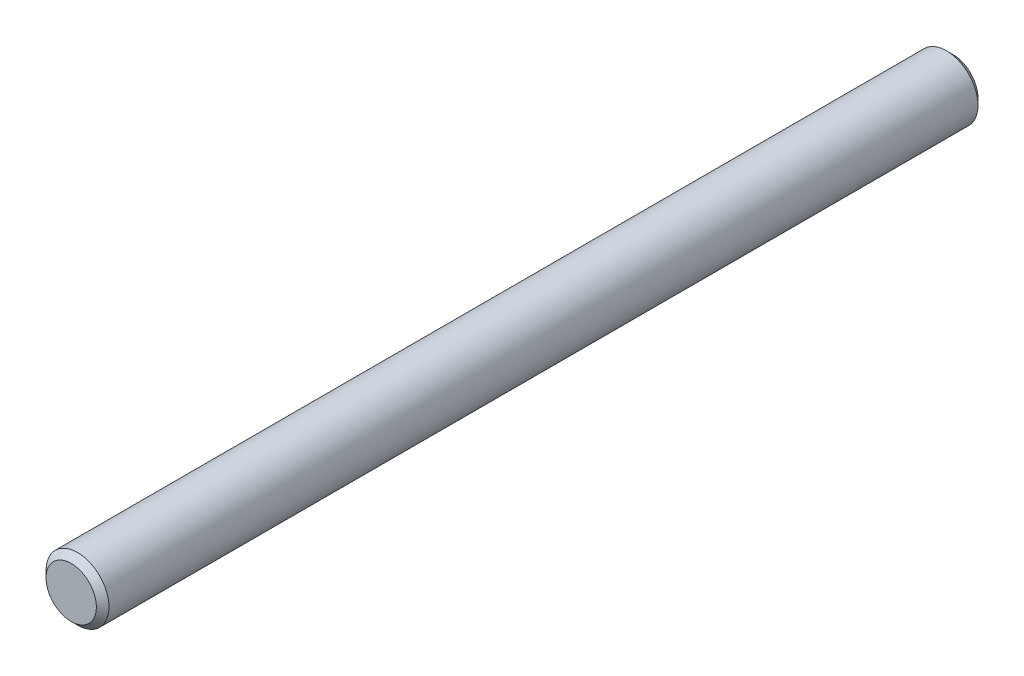
ISO-10303-21;
HEADER;
FILE_DESCRIPTION(('STEP AP214'),'2;1');
FILE_NAME('part.step','',(''),(''),'','','');
FILE_SCHEMA(('AUTOMOTIVE_DESIGN { 1 0 10303 214 1 1 1 1 }'));
ENDSEC;
DATA;
#1=APPLICATION_CONTEXT('core data for automotive mechanical design processes');
#2=APPLICATION_PROTOCOL_DEFINITION('international standard','automotive_design',2000,#1);
#3=PRODUCT_CONTEXT('',#1,'mechanical');
#4=PRODUCT('Part','Part','',(#3));
#5=PRODUCT_RELATED_PRODUCT_CATEGORY('part','',(#4));
#6=PRODUCT_DEFINITION_FORMATION('','',#4);
#7=PRODUCT_DEFINITION_CONTEXT('part definition',#1,'design');
#8=PRODUCT_DEFINITION('design','',#6,#7);
#9=PRODUCT_DEFINITION_SHAPE('','',#8);
#10=(LENGTH_UNIT() NAMED_UNIT(*) SI_UNIT(.MILLI.,.METRE.));
#11=(NAMED_UNIT(*) PLANE_ANGLE_UNIT() SI_UNIT($,.RADIAN.));
#12=(NAMED_UNIT(*) SI_UNIT($,.STERADIAN.) SOLID_ANGLE_UNIT());
#13=UNCERTAINTY_MEASURE_WITH_UNIT(LENGTH_MEASURE(1.E-05),#10,'distance_accuracy_value','');
#14=(GEOMETRIC_REPRESENTATION_CONTEXT(3) GLOBAL_UNCERTAINTY_ASSIGNED_CONTEXT((#13)) GLOBAL_UNIT_ASSIGNED_CONTEXT((#10,
#11,#12)) REPRESENTATION_CONTEXT('',''));
#15=CARTESIAN_POINT('',(0.,0.,0.));
#16=DIRECTION('',(0.,0.,1.));
#17=DIRECTION('',(1.,0.,0.));
#18=AXIS2_PLACEMENT_3D('',#15,#16,#17);
#19=CARTESIAN_POINT('',(0.,0.,70.));
#20=DIRECTION('',(0.,0.,-1.));
#21=DIRECTION('',(-1.,0.,0.));
#22=AXIS2_PLACEMENT_3D('',#19,#20,#21);
#23=CYLINDRICAL_SURFACE('',#22,2.5);
#24=CARTESIAN_POINT('',(0.,0.,69.5));
#25=DIRECTION('',(0.,0.,1.));
#26=DIRECTION('',(1.,0.,0.));
#27=AXIS2_PLACEMENT_3D('',#24,#25,#26);
#28=CIRCLE('',#27,2.5);
#29=CARTESIAN_POINT('',(2.5,0.,69.5));
#30=VERTEX_POINT('',#29);
#31=EDGE_CURVE('E45',#30,#30,#28,.F.);
#32=ORIENTED_EDGE('',*,*,#31,.T.);
#33=EDGE_LOOP('',(#32));
#34=FACE_BOUND('',#33,.T.);
#35=CARTESIAN_POINT('',(0.,0.,0.500000000000014));
#36=DIRECTION('',(0.,0.,1.));
#37=DIRECTION('',(1.,0.,0.));
#38=AXIS2_PLACEMENT_3D('',#35,#36,#37);
#39=CIRCLE('',#38,2.5);
#40=CARTESIAN_POINT('',(2.5,0.,0.500000000000014));
#41=VERTEX_POINT('',#40);
#42=EDGE_CURVE('E50',#41,#41,#39,.T.);
#43=ORIENTED_EDGE('',*,*,#42,.T.);
#44=EDGE_LOOP('',(#43));
#45=FACE_BOUND('',#44,.T.);
#46=ADVANCED_FACE('F37',(#34,#45),#23,.T.);
#47=CARTESIAN_POINT('',(0.,0.,70.));
#48=DIRECTION('',(0.,0.,1.));
#49=DIRECTION('',(1.,0.,0.));
#50=AXIS2_PLACEMENT_3D('',#47,#48,#49);
#51=PLANE('',#50);
#52=CARTESIAN_POINT('',(0.,0.,70.));
#53=DIRECTION('',(0.,0.,1.));
#54=DIRECTION('',(1.,0.,0.));
#55=AXIS2_PLACEMENT_3D('',#52,#53,#54);
#56=CIRCLE('',#55,2.);
#57=CARTESIAN_POINT('',(2.,0.,70.));
#58=VERTEX_POINT('',#57);
#59=EDGE_CURVE('E55',#58,#58,#56,.T.);
#60=ORIENTED_EDGE('',*,*,#59,.T.);
#61=EDGE_LOOP('',(#60));
#62=FACE_BOUND('',#61,.T.);
#63=ADVANCED_FACE('F62',(#62),#51,.T.);
#64=CARTESIAN_POINT('',(0.,0.,0.));
#65=DIRECTION('',(0.,0.,1.));
#66=DIRECTION('',(1.,0.,0.));
#67=AXIS2_PLACEMENT_3D('',#64,#65,#66);
#68=PLANE('',#67);
#69=CARTESIAN_POINT('',(0.,0.,0.));
#70=DIRECTION('',(0.,0.,1.));
#71=DIRECTION('',(1.,0.,0.));
#72=AXIS2_PLACEMENT_3D('',#69,#70,#71);
#73=CIRCLE('',#72,1.99999999999999);
#74=CARTESIAN_POINT('',(1.99999999999999,0.,0.));
#75=VERTEX_POINT('',#74);
#76=EDGE_CURVE('E10',#75,#75,#73,.F.);
#77=ORIENTED_EDGE('',*,*,#76,.T.);
#78=EDGE_LOOP('',(#77));
#79=FACE_BOUND('',#78,.T.);
#80=ADVANCED_FACE('F66',(#79),#68,.F.);
#81=CARTESIAN_POINT('',(0.,0.,70.));
#82=DIRECTION('',(0.,0.,-1.));
#83=DIRECTION('',(-1.,0.,0.));
#84=AXIS2_PLACEMENT_3D('',#81,#82,#83);
#85=CONICAL_SURFACE('',#84,2.,0.785398163397446);
#86=ORIENTED_EDGE('',*,*,#31,.F.);
#87=EDGE_LOOP('',(#86));
#88=FACE_BOUND('',#87,.T.);
#89=ORIENTED_EDGE('',*,*,#59,.F.);
#90=EDGE_LOOP('',(#89));
#91=FACE_BOUND('',#90,.T.);
#92=ADVANCED_FACE('F64',(#88,#91),#85,.T.);
#93=CARTESIAN_POINT('',(0.,0.,0.500000000000014));
#94=DIRECTION('',(0.,0.,1.));
#95=DIRECTION('',(1.,0.,0.));
#96=AXIS2_PLACEMENT_3D('',#93,#94,#95);
#97=CONICAL_SURFACE('',#96,2.5,0.785398163397446);
#98=ORIENTED_EDGE('',*,*,#76,.F.);
#99=EDGE_LOOP('',(#98));
#100=FACE_BOUND('',#99,.T.);
#101=ORIENTED_EDGE('',*,*,#42,.F.);
#102=EDGE_LOOP('',(#101));
#103=FACE_BOUND('',#102,.T.);
#104=ADVANCED_FACE('F39',(#100,#103),#97,.T.);
#105=CLOSED_SHELL('',(#46,#63,#80,#92,#104));
#106=MANIFOLD_SOLID_BREP('B2',#105);
#107=ADVANCED_BREP_SHAPE_REPRESENTATION('',(#18,#106),#14);
#108=SHAPE_DEFINITION_REPRESENTATION(#9,#107);
ENDSEC;
END-ISO-10303-21;
